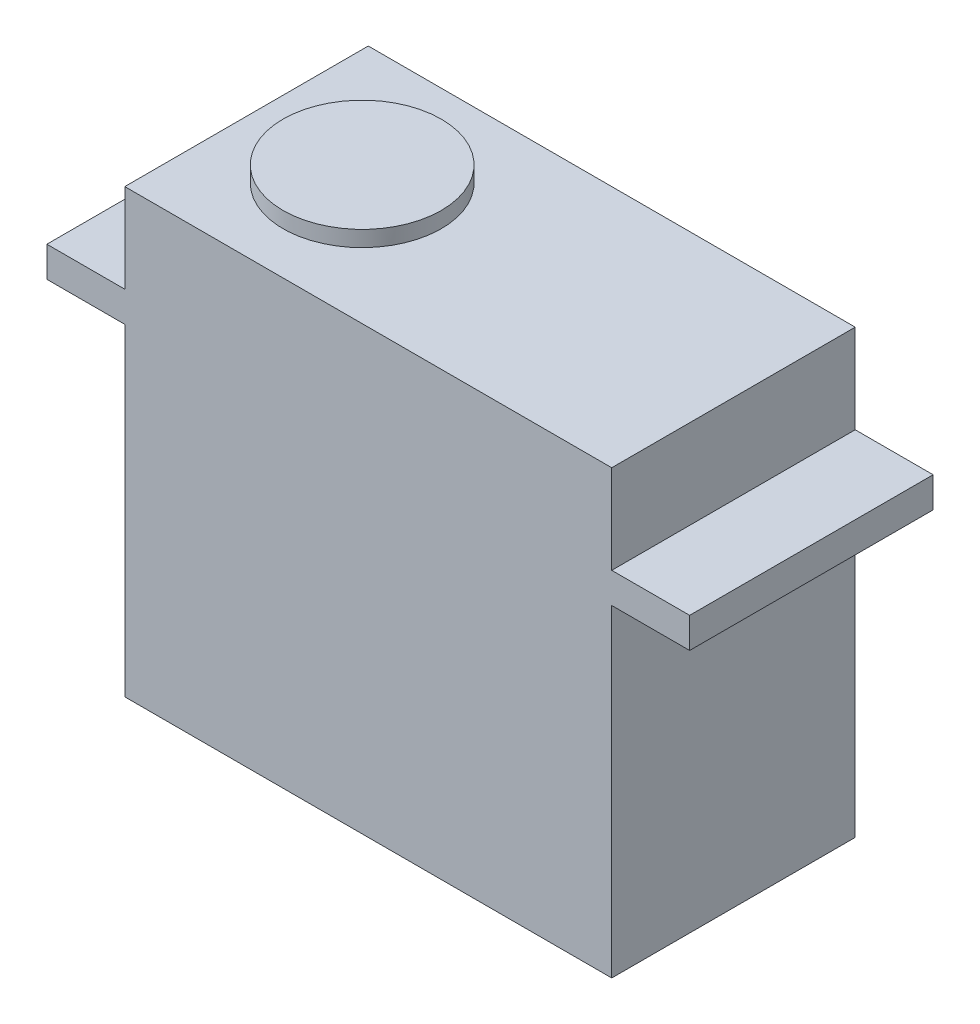
ISO-10303-21;
HEADER;
FILE_DESCRIPTION(('STEP AP214'),'2;1');
FILE_NAME('part.step','',(''),(''),'','','');
FILE_SCHEMA(('AUTOMOTIVE_DESIGN { 1 0 10303 214 1 1 1 1 }'));
ENDSEC;
DATA;
#1=APPLICATION_CONTEXT('core data for automotive mechanical design processes');
#2=APPLICATION_PROTOCOL_DEFINITION('international standard','automotive_design',2000,#1);
#3=PRODUCT_CONTEXT('',#1,'mechanical');
#4=PRODUCT('Part','Part','',(#3));
#5=PRODUCT_RELATED_PRODUCT_CATEGORY('part','',(#4));
#6=PRODUCT_DEFINITION_FORMATION('','',#4);
#7=PRODUCT_DEFINITION_CONTEXT('part definition',#1,'design');
#8=PRODUCT_DEFINITION('design','',#6,#7);
#9=PRODUCT_DEFINITION_SHAPE('','',#8);
#10=(LENGTH_UNIT() NAMED_UNIT(*) SI_UNIT(.MILLI.,.METRE.));
#11=(NAMED_UNIT(*) PLANE_ANGLE_UNIT() SI_UNIT($,.RADIAN.));
#12=(NAMED_UNIT(*) SI_UNIT($,.STERADIAN.) SOLID_ANGLE_UNIT());
#13=UNCERTAINTY_MEASURE_WITH_UNIT(LENGTH_MEASURE(1.E-05),#10,'distance_accuracy_value','');
#14=(GEOMETRIC_REPRESENTATION_CONTEXT(3) GLOBAL_UNCERTAINTY_ASSIGNED_CONTEXT((#13)) GLOBAL_UNIT_ASSIGNED_CONTEXT((#10,
#11,#12)) REPRESENTATION_CONTEXT('',''));
#15=CARTESIAN_POINT('',(0.,0.,0.));
#16=DIRECTION('',(0.,0.,1.));
#17=DIRECTION('',(1.,0.,0.));
#18=AXIS2_PLACEMENT_3D('',#15,#16,#17);
#19=CARTESIAN_POINT('',(0.,29.,0.));
#20=DIRECTION('',(0.,-1.,0.));
#21=DIRECTION('',(0.,0.,-1.));
#22=AXIS2_PLACEMENT_3D('',#19,#20,#21);
#23=PLANE('',#22);
#24=DIRECTION('',(0.,0.,-1.));
#25=VECTOR('',#24,1.);
#26=CARTESIAN_POINT('',(20.,29.,10.));
#27=LINE('',#26,#25);
#28=CARTESIAN_POINT('',(20.,29.,10.));
#29=VERTEX_POINT('',#28);
#30=CARTESIAN_POINT('',(20.,29.,-10.));
#31=VERTEX_POINT('',#30);
#32=EDGE_CURVE('E48',#29,#31,#27,.T.);
#33=ORIENTED_EDGE('',*,*,#32,.F.);
#34=DIRECTION('',(1.,0.,0.));
#35=VECTOR('',#34,1.);
#36=CARTESIAN_POINT('',(-26.4,29.,10.));
#37=LINE('',#36,#35);
#38=CARTESIAN_POINT('',(26.4,29.,10.));
#39=VERTEX_POINT('',#38);
#40=EDGE_CURVE('E161',#29,#39,#37,.T.);
#41=ORIENTED_EDGE('',*,*,#40,.T.);
#42=DIRECTION('',(0.,0.,-1.));
#43=VECTOR('',#42,1.);
#44=CARTESIAN_POINT('',(26.4,29.,10.));
#45=LINE('',#44,#43);
#46=CARTESIAN_POINT('',(26.4,29.,-10.));
#47=VERTEX_POINT('',#46);
#48=EDGE_CURVE('E152',#39,#47,#45,.T.);
#49=ORIENTED_EDGE('',*,*,#48,.T.);
#50=DIRECTION('',(-1.,0.,0.));
#51=VECTOR('',#50,1.);
#52=CARTESIAN_POINT('',(-26.4,29.,-10.));
#53=LINE('',#52,#51);
#54=EDGE_CURVE('E157',#47,#31,#53,.T.);
#55=ORIENTED_EDGE('',*,*,#54,.T.);
#56=EDGE_LOOP('',(#33,#41,#49,#55));
#57=FACE_BOUND('',#56,.T.);
#58=ADVANCED_FACE('F33',(#57),#23,.F.);
#59=DIRECTION('',(0.,0.,1.));
#60=VECTOR('',#59,1.);
#61=CARTESIAN_POINT('',(-20.,29.,10.));
#62=LINE('',#61,#60);
#63=CARTESIAN_POINT('',(-20.,29.,-10.));
#64=VERTEX_POINT('',#63);
#65=CARTESIAN_POINT('',(-20.,29.,10.));
#66=VERTEX_POINT('',#65);
#67=EDGE_CURVE('E56',#64,#66,#62,.T.);
#68=ORIENTED_EDGE('',*,*,#67,.F.);
#69=CARTESIAN_POINT('',(-26.4,29.,-10.));
#70=VERTEX_POINT('',#69);
#71=EDGE_CURVE('E155',#64,#70,#53,.T.);
#72=ORIENTED_EDGE('',*,*,#71,.T.);
#73=DIRECTION('',(0.,0.,1.));
#74=VECTOR('',#73,1.);
#75=CARTESIAN_POINT('',(-26.4,29.,10.));
#76=LINE('',#75,#74);
#77=CARTESIAN_POINT('',(-26.4,29.,10.));
#78=VERTEX_POINT('',#77);
#79=EDGE_CURVE('E159',#70,#78,#76,.T.);
#80=ORIENTED_EDGE('',*,*,#79,.T.);
#81=EDGE_CURVE('E162',#78,#66,#37,.T.);
#82=ORIENTED_EDGE('',*,*,#81,.T.);
#83=EDGE_LOOP('',(#68,#72,#80,#82));
#84=FACE_BOUND('',#83,.T.);
#85=ADVANCED_FACE('F231',(#84),#23,.F.);
#86=CARTESIAN_POINT('',(20.,26.5,10.));
#87=DIRECTION('',(-1.,0.,0.));
#88=DIRECTION('',(0.,0.,1.));
#89=AXIS2_PLACEMENT_3D('',#86,#87,#88);
#90=PLANE('',#89);
#91=DIRECTION('',(0.,0.,-1.));
#92=VECTOR('',#91,1.);
#93=CARTESIAN_POINT('',(20.,0.,10.));
#94=LINE('',#93,#92);
#95=CARTESIAN_POINT('',(20.,0.,10.));
#96=VERTEX_POINT('',#95);
#97=CARTESIAN_POINT('',(20.,0.,-10.));
#98=VERTEX_POINT('',#97);
#99=EDGE_CURVE('E184',#96,#98,#94,.T.);
#100=ORIENTED_EDGE('',*,*,#99,.T.);
#101=DIRECTION('',(0.,-1.,0.));
#102=VECTOR('',#101,1.);
#103=CARTESIAN_POINT('',(20.,26.5,-10.));
#104=LINE('',#103,#102);
#105=CARTESIAN_POINT('',(20.,26.5,-10.));
#106=VERTEX_POINT('',#105);
#107=EDGE_CURVE('E41',#106,#98,#104,.T.);
#108=ORIENTED_EDGE('',*,*,#107,.F.);
#109=DIRECTION('',(0.,0.,-1.));
#110=VECTOR('',#109,1.);
#111=CARTESIAN_POINT('',(20.,26.5,10.));
#112=LINE('',#111,#110);
#113=CARTESIAN_POINT('',(20.,26.5,10.));
#114=VERTEX_POINT('',#113);
#115=EDGE_CURVE('E185',#114,#106,#112,.T.);
#116=ORIENTED_EDGE('',*,*,#115,.F.);
#117=DIRECTION('',(0.,-1.,0.));
#118=VECTOR('',#117,1.);
#119=CARTESIAN_POINT('',(20.,26.5,10.));
#120=LINE('',#119,#118);
#121=EDGE_CURVE('E192',#114,#96,#120,.T.);
#122=ORIENTED_EDGE('',*,*,#121,.T.);
#123=EDGE_LOOP('',(#100,#108,#116,#122));
#124=FACE_BOUND('',#123,.T.);
#125=ADVANCED_FACE('F35',(#124),#90,.F.);
#126=CARTESIAN_POINT('',(-20.,26.5,-10.));
#127=DIRECTION('',(0.,0.,1.));
#128=DIRECTION('',(1.,0.,0.));
#129=AXIS2_PLACEMENT_3D('',#126,#127,#128);
#130=PLANE('',#129);
#131=DIRECTION('',(-1.,0.,0.));
#132=VECTOR('',#131,1.);
#133=CARTESIAN_POINT('',(-20.,0.,-10.));
#134=LINE('',#133,#132);
#135=CARTESIAN_POINT('',(-20.,0.,-10.));
#136=VERTEX_POINT('',#135);
#137=EDGE_CURVE('E195',#98,#136,#134,.T.);
#138=ORIENTED_EDGE('',*,*,#137,.T.);
#139=DIRECTION('',(0.,-1.,0.));
#140=VECTOR('',#139,1.);
#141=CARTESIAN_POINT('',(-20.,26.5,-10.));
#142=LINE('',#141,#140);
#143=CARTESIAN_POINT('',(-20.,26.5,-10.));
#144=VERTEX_POINT('',#143);
#145=EDGE_CURVE('E205',#144,#136,#142,.T.);
#146=ORIENTED_EDGE('',*,*,#145,.F.);
#147=DIRECTION('',(-1.,0.,0.));
#148=VECTOR('',#147,1.);
#149=CARTESIAN_POINT('',(-26.4,26.5,-10.));
#150=LINE('',#149,#148);
#151=CARTESIAN_POINT('',(-26.4,26.5,-10.));
#152=VERTEX_POINT('',#151);
#153=EDGE_CURVE('E146',#144,#152,#150,.T.);
#154=ORIENTED_EDGE('',*,*,#153,.T.);
#155=DIRECTION('',(0.,-1.,0.));
#156=VECTOR('',#155,1.);
#157=CARTESIAN_POINT('',(-26.4,29.,-10.));
#158=LINE('',#157,#156);
#159=EDGE_CURVE('E178',#70,#152,#158,.T.);
#160=ORIENTED_EDGE('',*,*,#159,.F.);
#161=ORIENTED_EDGE('',*,*,#71,.F.);
#162=DIRECTION('',(0.,-1.,0.));
#163=VECTOR('',#162,1.);
#164=CARTESIAN_POINT('',(-20.,36.3,-10.));
#165=LINE('',#164,#163);
#166=CARTESIAN_POINT('',(-20.,36.3,-10.));
#167=VERTEX_POINT('',#166);
#168=EDGE_CURVE('E128',#167,#64,#165,.T.);
#169=ORIENTED_EDGE('',*,*,#168,.F.);
#170=DIRECTION('',(-1.,0.,0.));
#171=VECTOR('',#170,1.);
#172=CARTESIAN_POINT('',(-20.,36.3,-10.));
#173=LINE('',#172,#171);
#174=CARTESIAN_POINT('',(20.,36.3,-10.));
#175=VERTEX_POINT('',#174);
#176=EDGE_CURVE('E122',#175,#167,#173,.T.);
#177=ORIENTED_EDGE('',*,*,#176,.F.);
#178=DIRECTION('',(0.,-1.,0.));
#179=VECTOR('',#178,1.);
#180=CARTESIAN_POINT('',(20.,36.3,-10.));
#181=LINE('',#180,#179);
#182=EDGE_CURVE('E126',#175,#31,#181,.T.);
#183=ORIENTED_EDGE('',*,*,#182,.T.);
#184=ORIENTED_EDGE('',*,*,#54,.F.);
#185=DIRECTION('',(0.,-1.,0.));
#186=VECTOR('',#185,1.);
#187=CARTESIAN_POINT('',(26.4,29.,-10.));
#188=LINE('',#187,#186);
#189=CARTESIAN_POINT('',(26.4,26.5,-10.));
#190=VERTEX_POINT('',#189);
#191=EDGE_CURVE('E181',#47,#190,#188,.T.);
#192=ORIENTED_EDGE('',*,*,#191,.T.);
#193=EDGE_CURVE('E165',#190,#106,#150,.T.);
#194=ORIENTED_EDGE('',*,*,#193,.T.);
#195=ORIENTED_EDGE('',*,*,#107,.T.);
#196=EDGE_LOOP('',(#138,#146,#154,#160,#161,#169,#177,#183,#184,#192,#194,#195));
#197=FACE_BOUND('',#196,.T.);
#198=ADVANCED_FACE('F124',(#197),#130,.F.);
#199=CARTESIAN_POINT('',(-20.,26.5,10.));
#200=DIRECTION('',(1.,0.,0.));
#201=DIRECTION('',(0.,0.,-1.));
#202=AXIS2_PLACEMENT_3D('',#199,#200,#201);
#203=PLANE('',#202);
#204=DIRECTION('',(0.,0.,1.));
#205=VECTOR('',#204,1.);
#206=CARTESIAN_POINT('',(-20.,0.,10.));
#207=LINE('',#206,#205);
#208=CARTESIAN_POINT('',(-20.,0.,10.));
#209=VERTEX_POINT('',#208);
#210=EDGE_CURVE('E197',#136,#209,#207,.T.);
#211=ORIENTED_EDGE('',*,*,#210,.T.);
#212=DIRECTION('',(0.,-1.,0.));
#213=VECTOR('',#212,1.);
#214=CARTESIAN_POINT('',(-20.,26.5,10.));
#215=LINE('',#214,#213);
#216=CARTESIAN_POINT('',(-20.,26.5,10.));
#217=VERTEX_POINT('',#216);
#218=EDGE_CURVE('E202',#217,#209,#215,.T.);
#219=ORIENTED_EDGE('',*,*,#218,.F.);
#220=DIRECTION('',(0.,0.,1.));
#221=VECTOR('',#220,1.);
#222=CARTESIAN_POINT('',(-20.,26.5,10.));
#223=LINE('',#222,#221);
#224=EDGE_CURVE('E188',#144,#217,#223,.T.);
#225=ORIENTED_EDGE('',*,*,#224,.F.);
#226=ORIENTED_EDGE('',*,*,#145,.T.);
#227=EDGE_LOOP('',(#211,#219,#225,#226));
#228=FACE_BOUND('',#227,.T.);
#229=ADVANCED_FACE('F216',(#228),#203,.F.);
#230=CARTESIAN_POINT('',(-20.,26.5,10.));
#231=DIRECTION('',(0.,0.,-1.));
#232=DIRECTION('',(-1.,0.,0.));
#233=AXIS2_PLACEMENT_3D('',#230,#231,#232);
#234=PLANE('',#233);
#235=DIRECTION('',(1.,0.,0.));
#236=VECTOR('',#235,1.);
#237=CARTESIAN_POINT('',(-20.,0.,10.));
#238=LINE('',#237,#236);
#239=EDGE_CURVE('E189',#209,#96,#238,.T.);
#240=ORIENTED_EDGE('',*,*,#239,.T.);
#241=ORIENTED_EDGE('',*,*,#121,.F.);
#242=DIRECTION('',(1.,0.,0.));
#243=VECTOR('',#242,1.);
#244=CARTESIAN_POINT('',(-26.4,26.5,10.));
#245=LINE('',#244,#243);
#246=CARTESIAN_POINT('',(26.4,26.5,10.));
#247=VERTEX_POINT('',#246);
#248=EDGE_CURVE('E170',#114,#247,#245,.T.);
#249=ORIENTED_EDGE('',*,*,#248,.T.);
#250=DIRECTION('',(0.,-1.,0.));
#251=VECTOR('',#250,1.);
#252=CARTESIAN_POINT('',(26.4,29.,10.));
#253=LINE('',#252,#251);
#254=EDGE_CURVE('E163',#39,#247,#253,.T.);
#255=ORIENTED_EDGE('',*,*,#254,.F.);
#256=ORIENTED_EDGE('',*,*,#40,.F.);
#257=DIRECTION('',(0.,-1.,0.));
#258=VECTOR('',#257,1.);
#259=CARTESIAN_POINT('',(20.,36.3,10.));
#260=LINE('',#259,#258);
#261=CARTESIAN_POINT('',(20.,36.3,10.));
#262=VERTEX_POINT('',#261);
#263=EDGE_CURVE('E237',#262,#29,#260,.T.);
#264=ORIENTED_EDGE('',*,*,#263,.F.);
#265=DIRECTION('',(1.,0.,0.));
#266=VECTOR('',#265,1.);
#267=CARTESIAN_POINT('',(-20.,36.3,10.));
#268=LINE('',#267,#266);
#269=CARTESIAN_POINT('',(-20.,36.3,10.));
#270=VERTEX_POINT('',#269);
#271=EDGE_CURVE('E137',#270,#262,#268,.T.);
#272=ORIENTED_EDGE('',*,*,#271,.F.);
#273=DIRECTION('',(0.,-1.,0.));
#274=VECTOR('',#273,1.);
#275=CARTESIAN_POINT('',(-20.,36.3,10.));
#276=LINE('',#275,#274);
#277=EDGE_CURVE('E148',#270,#66,#276,.T.);
#278=ORIENTED_EDGE('',*,*,#277,.T.);
#279=ORIENTED_EDGE('',*,*,#81,.F.);
#280=DIRECTION('',(0.,-1.,0.));
#281=VECTOR('',#280,1.);
#282=CARTESIAN_POINT('',(-26.4,29.,10.));
#283=LINE('',#282,#281);
#284=CARTESIAN_POINT('',(-26.4,26.5,10.));
#285=VERTEX_POINT('',#284);
#286=EDGE_CURVE('E175',#78,#285,#283,.T.);
#287=ORIENTED_EDGE('',*,*,#286,.T.);
#288=EDGE_CURVE('E156',#285,#217,#245,.T.);
#289=ORIENTED_EDGE('',*,*,#288,.T.);
#290=ORIENTED_EDGE('',*,*,#218,.T.);
#291=EDGE_LOOP('',(#240,#241,#249,#255,#256,#264,#272,#278,#279,#287,#289,#290));
#292=FACE_BOUND('',#291,.T.);
#293=ADVANCED_FACE('F219',(#292),#234,.F.);
#294=CARTESIAN_POINT('',(0.,0.,0.));
#295=DIRECTION('',(0.,-1.,0.));
#296=DIRECTION('',(0.,0.,-1.));
#297=AXIS2_PLACEMENT_3D('',#294,#295,#296);
#298=PLANE('',#297);
#299=ORIENTED_EDGE('',*,*,#99,.F.);
#300=ORIENTED_EDGE('',*,*,#239,.F.);
#301=ORIENTED_EDGE('',*,*,#210,.F.);
#302=ORIENTED_EDGE('',*,*,#137,.F.);
#303=EDGE_LOOP('',(#299,#300,#301,#302));
#304=FACE_BOUND('',#303,.T.);
#305=ADVANCED_FACE('F213',(#304),#298,.T.);
#306=CARTESIAN_POINT('',(0.,26.5,0.));
#307=DIRECTION('',(0.,-1.,0.));
#308=DIRECTION('',(0.,0.,-1.));
#309=AXIS2_PLACEMENT_3D('',#306,#307,#308);
#310=PLANE('',#309);
#311=ORIENTED_EDGE('',*,*,#248,.F.);
#312=ORIENTED_EDGE('',*,*,#115,.T.);
#313=ORIENTED_EDGE('',*,*,#193,.F.);
#314=DIRECTION('',(0.,0.,-1.));
#315=VECTOR('',#314,1.);
#316=CARTESIAN_POINT('',(26.4,26.5,10.));
#317=LINE('',#316,#315);
#318=EDGE_CURVE('E143',#247,#190,#317,.T.);
#319=ORIENTED_EDGE('',*,*,#318,.F.);
#320=EDGE_LOOP('',(#311,#312,#313,#319));
#321=FACE_BOUND('',#320,.T.);
#322=ADVANCED_FACE('F251',(#321),#310,.T.);
#323=CARTESIAN_POINT('',(26.4,29.,10.));
#324=DIRECTION('',(-1.,0.,0.));
#325=DIRECTION('',(0.,0.,1.));
#326=AXIS2_PLACEMENT_3D('',#323,#324,#325);
#327=PLANE('',#326);
#328=ORIENTED_EDGE('',*,*,#318,.T.);
#329=ORIENTED_EDGE('',*,*,#191,.F.);
#330=ORIENTED_EDGE('',*,*,#48,.F.);
#331=ORIENTED_EDGE('',*,*,#254,.T.);
#332=EDGE_LOOP('',(#328,#329,#330,#331));
#333=FACE_BOUND('',#332,.T.);
#334=ADVANCED_FACE('F247',(#333),#327,.F.);
#335=CARTESIAN_POINT('',(-26.4,29.,10.));
#336=DIRECTION('',(1.,0.,0.));
#337=DIRECTION('',(0.,0.,-1.));
#338=AXIS2_PLACEMENT_3D('',#335,#336,#337);
#339=PLANE('',#338);
#340=DIRECTION('',(0.,0.,1.));
#341=VECTOR('',#340,1.);
#342=CARTESIAN_POINT('',(-26.4,26.5,10.));
#343=LINE('',#342,#341);
#344=EDGE_CURVE('E168',#152,#285,#343,.T.);
#345=ORIENTED_EDGE('',*,*,#344,.T.);
#346=ORIENTED_EDGE('',*,*,#286,.F.);
#347=ORIENTED_EDGE('',*,*,#79,.F.);
#348=ORIENTED_EDGE('',*,*,#159,.T.);
#349=EDGE_LOOP('',(#345,#346,#347,#348));
#350=FACE_BOUND('',#349,.T.);
#351=ADVANCED_FACE('F230',(#350),#339,.F.);
#352=ORIENTED_EDGE('',*,*,#153,.F.);
#353=ORIENTED_EDGE('',*,*,#224,.T.);
#354=ORIENTED_EDGE('',*,*,#288,.F.);
#355=ORIENTED_EDGE('',*,*,#344,.F.);
#356=EDGE_LOOP('',(#352,#353,#354,#355));
#357=FACE_BOUND('',#356,.T.);
#358=ADVANCED_FACE('F226',(#357),#310,.T.);
#359=CARTESIAN_POINT('',(20.,36.3,10.));
#360=DIRECTION('',(-1.,0.,0.));
#361=DIRECTION('',(0.,0.,1.));
#362=AXIS2_PLACEMENT_3D('',#359,#360,#361);
#363=PLANE('',#362);
#364=ORIENTED_EDGE('',*,*,#32,.T.);
#365=ORIENTED_EDGE('',*,*,#182,.F.);
#366=DIRECTION('',(0.,0.,-1.));
#367=VECTOR('',#366,1.);
#368=CARTESIAN_POINT('',(20.,36.3,10.));
#369=LINE('',#368,#367);
#370=EDGE_CURVE('E132',#262,#175,#369,.T.);
#371=ORIENTED_EDGE('',*,*,#370,.F.);
#372=ORIENTED_EDGE('',*,*,#263,.T.);
#373=EDGE_LOOP('',(#364,#365,#371,#372));
#374=FACE_BOUND('',#373,.T.);
#375=ADVANCED_FACE('F142',(#374),#363,.F.);
#376=CARTESIAN_POINT('',(-20.,36.3,10.));
#377=DIRECTION('',(1.,0.,0.));
#378=DIRECTION('',(0.,0.,-1.));
#379=AXIS2_PLACEMENT_3D('',#376,#377,#378);
#380=PLANE('',#379);
#381=ORIENTED_EDGE('',*,*,#67,.T.);
#382=ORIENTED_EDGE('',*,*,#277,.F.);
#383=DIRECTION('',(0.,0.,1.));
#384=VECTOR('',#383,1.);
#385=CARTESIAN_POINT('',(-20.,36.3,10.));
#386=LINE('',#385,#384);
#387=EDGE_CURVE('E131',#167,#270,#386,.T.);
#388=ORIENTED_EDGE('',*,*,#387,.F.);
#389=ORIENTED_EDGE('',*,*,#168,.T.);
#390=EDGE_LOOP('',(#381,#382,#388,#389));
#391=FACE_BOUND('',#390,.T.);
#392=ADVANCED_FACE('F233',(#391),#380,.F.);
#393=CARTESIAN_POINT('',(0.,36.3,0.));
#394=DIRECTION('',(0.,-1.,0.));
#395=DIRECTION('',(0.,0.,-1.));
#396=AXIS2_PLACEMENT_3D('',#393,#394,#395);
#397=PLANE('',#396);
#398=CARTESIAN_POINT('',(-10.5,36.3,0.));
#399=DIRECTION('',(0.,-1.,0.));
#400=DIRECTION('',(0.,0.,-1.));
#401=AXIS2_PLACEMENT_3D('',#398,#399,#400);
#402=CIRCLE('',#401,6.5);
#403=CARTESIAN_POINT('',(-10.5,36.3,-6.5));
#404=VERTEX_POINT('',#403);
#405=EDGE_CURVE('E11',#404,#404,#402,.F.);
#406=ORIENTED_EDGE('',*,*,#405,.F.);
#407=EDGE_LOOP('',(#406));
#408=FACE_BOUND('',#407,.T.);
#409=ORIENTED_EDGE('',*,*,#370,.T.);
#410=ORIENTED_EDGE('',*,*,#176,.T.);
#411=ORIENTED_EDGE('',*,*,#387,.T.);
#412=ORIENTED_EDGE('',*,*,#271,.T.);
#413=EDGE_LOOP('',(#409,#410,#411,#412));
#414=FACE_BOUND('',#413,.T.);
#415=ADVANCED_FACE('F135',(#408,#414),#397,.F.);
#416=CARTESIAN_POINT('',(-10.5,37.6,0.));
#417=DIRECTION('',(0.,-1.,0.));
#418=DIRECTION('',(0.,0.,-1.));
#419=AXIS2_PLACEMENT_3D('',#416,#417,#418);
#420=CYLINDRICAL_SURFACE('',#419,6.5);
#421=CARTESIAN_POINT('',(-10.5,37.6,0.));
#422=DIRECTION('',(0.,1.,0.));
#423=DIRECTION('',(0.,0.,1.));
#424=AXIS2_PLACEMENT_3D('',#421,#422,#423);
#425=CIRCLE('',#424,6.5);
#426=CARTESIAN_POINT('',(-10.5,37.6,6.5));
#427=VERTEX_POINT('',#426);
#428=EDGE_CURVE('E241',#427,#427,#425,.T.);
#429=ORIENTED_EDGE('',*,*,#428,.F.);
#430=EDGE_LOOP('',(#429));
#431=FACE_BOUND('',#430,.T.);
#432=ORIENTED_EDGE('',*,*,#405,.T.);
#433=EDGE_LOOP('',(#432));
#434=FACE_BOUND('',#433,.T.);
#435=ADVANCED_FACE('F274',(#431,#434),#420,.T.);
#436=CARTESIAN_POINT('',(-10.5,37.6,0.));
#437=DIRECTION('',(0.,1.,0.));
#438=DIRECTION('',(0.,0.,1.));
#439=AXIS2_PLACEMENT_3D('',#436,#437,#438);
#440=PLANE('',#439);
#441=ORIENTED_EDGE('',*,*,#428,.T.);
#442=EDGE_LOOP('',(#441));
#443=FACE_BOUND('',#442,.T.);
#444=ADVANCED_FACE('F278',(#443),#440,.T.);
#445=CLOSED_SHELL('',(#58,#85,#125,#198,#229,#293,#305,#322,#334,#351,#358,#375,#392,#415,#435,#444));
#446=MANIFOLD_SOLID_BREP('B2',#445);
#447=ADVANCED_BREP_SHAPE_REPRESENTATION('',(#18,#446),#14);
#448=SHAPE_DEFINITION_REPRESENTATION(#9,#447);
ENDSEC;
END-ISO-10303-21;
